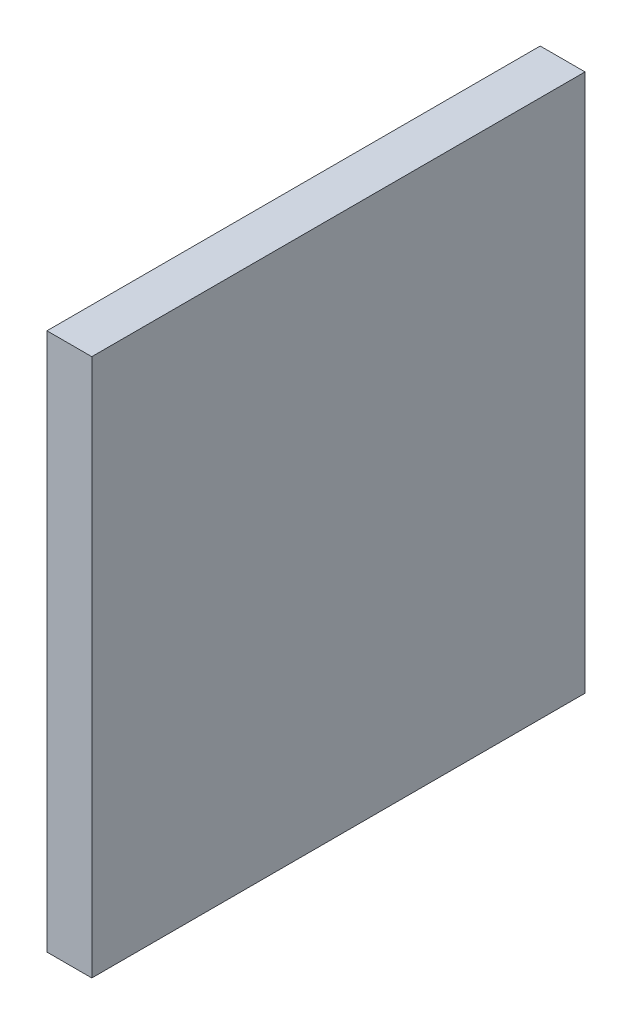
ISO-10303-21;
HEADER;
FILE_DESCRIPTION(('STEP AP214'),'2;1');
FILE_NAME('part.step','',(''),(''),'','','');
FILE_SCHEMA(('AUTOMOTIVE_DESIGN { 1 0 10303 214 1 1 1 1 }'));
ENDSEC;
DATA;
#1=APPLICATION_CONTEXT('core data for automotive mechanical design processes');
#2=APPLICATION_PROTOCOL_DEFINITION('international standard','automotive_design',2000,#1);
#3=PRODUCT_CONTEXT('',#1,'mechanical');
#4=PRODUCT('Part','Part','',(#3));
#5=PRODUCT_RELATED_PRODUCT_CATEGORY('part','',(#4));
#6=PRODUCT_DEFINITION_FORMATION('','',#4);
#7=PRODUCT_DEFINITION_CONTEXT('part definition',#1,'design');
#8=PRODUCT_DEFINITION('design','',#6,#7);
#9=PRODUCT_DEFINITION_SHAPE('','',#8);
#10=(LENGTH_UNIT() NAMED_UNIT(*) SI_UNIT(.MILLI.,.METRE.));
#11=(NAMED_UNIT(*) PLANE_ANGLE_UNIT() SI_UNIT($,.RADIAN.));
#12=(NAMED_UNIT(*) SI_UNIT($,.STERADIAN.) SOLID_ANGLE_UNIT());
#13=UNCERTAINTY_MEASURE_WITH_UNIT(LENGTH_MEASURE(1.E-05),#10,'distance_accuracy_value','');
#14=(GEOMETRIC_REPRESENTATION_CONTEXT(3) GLOBAL_UNCERTAINTY_ASSIGNED_CONTEXT((#13)) GLOBAL_UNIT_ASSIGNED_CONTEXT((#10,
#11,#12)) REPRESENTATION_CONTEXT('',''));
#15=CARTESIAN_POINT('',(0.,0.,0.));
#16=DIRECTION('',(0.,0.,1.));
#17=DIRECTION('',(1.,0.,0.));
#18=AXIS2_PLACEMENT_3D('',#15,#16,#17);
#19=CARTESIAN_POINT('',(28.99,3.37,5.7));
#20=DIRECTION('',(1.,0.,0.));
#21=DIRECTION('',(0.,0.,-1.));
#22=AXIS2_PLACEMENT_3D('',#19,#20,#21);
#23=PLANE('',#22);
#24=DIRECTION('',(0.,1.,0.));
#25=VECTOR('',#24,1.);
#26=CARTESIAN_POINT('',(28.99,5.17,7.35));
#27=LINE('',#26,#25);
#28=CARTESIAN_POINT('',(28.99,5.17,7.35));
#29=VERTEX_POINT('',#28);
#30=CARTESIAN_POINT('',(28.99,1.57,7.35));
#31=VERTEX_POINT('',#30);
#32=EDGE_CURVE('E79',#29,#31,#27,.F.);
#33=ORIENTED_EDGE('',*,*,#32,.F.);
#34=DIRECTION('',(0.,0.,1.));
#35=VECTOR('',#34,1.);
#36=CARTESIAN_POINT('',(28.99,5.17,4.05));
#37=LINE('',#36,#35);
#38=CARTESIAN_POINT('',(28.99,5.17,4.05));
#39=VERTEX_POINT('',#38);
#40=EDGE_CURVE('E55',#39,#29,#37,.T.);
#41=ORIENTED_EDGE('',*,*,#40,.F.);
#42=DIRECTION('',(0.,1.,0.));
#43=VECTOR('',#42,1.);
#44=CARTESIAN_POINT('',(28.99,1.57,4.05));
#45=LINE('',#44,#43);
#46=CARTESIAN_POINT('',(28.99,1.57,4.05));
#47=VERTEX_POINT('',#46);
#48=EDGE_CURVE('E57',#47,#39,#45,.T.);
#49=ORIENTED_EDGE('',*,*,#48,.F.);
#50=DIRECTION('',(0.,0.,-1.));
#51=VECTOR('',#50,1.);
#52=CARTESIAN_POINT('',(28.99,1.57,7.35));
#53=LINE('',#52,#51);
#54=EDGE_CURVE('E20',#31,#47,#53,.T.);
#55=ORIENTED_EDGE('',*,*,#54,.F.);
#56=EDGE_LOOP('',(#33,#41,#49,#55));
#57=FACE_BOUND('',#56,.T.);
#58=ADVANCED_FACE('F17',(#57),#23,.F.);
#59=CARTESIAN_POINT('',(28.99,1.57,7.35));
#60=DIRECTION('',(0.,-1.,0.));
#61=DIRECTION('',(0.,0.,-1.));
#62=AXIS2_PLACEMENT_3D('',#59,#60,#61);
#63=PLANE('',#62);
#64=DIRECTION('',(0.,0.,-1.));
#65=VECTOR('',#64,1.);
#66=CARTESIAN_POINT('',(29.29,1.57,5.7));
#67=LINE('',#66,#65);
#68=CARTESIAN_POINT('',(29.29,1.57,7.35));
#69=VERTEX_POINT('',#68);
#70=CARTESIAN_POINT('',(29.29,1.57,4.05));
#71=VERTEX_POINT('',#70);
#72=EDGE_CURVE('E83',#69,#71,#67,.T.);
#73=ORIENTED_EDGE('',*,*,#72,.F.);
#74=DIRECTION('',(1.,0.,0.));
#75=VECTOR('',#74,1.);
#76=CARTESIAN_POINT('',(28.99,1.57,7.35));
#77=LINE('',#76,#75);
#78=EDGE_CURVE('E68',#31,#69,#77,.T.);
#79=ORIENTED_EDGE('',*,*,#78,.F.);
#80=ORIENTED_EDGE('',*,*,#54,.T.);
#81=DIRECTION('',(-1.,0.,0.));
#82=VECTOR('',#81,1.);
#83=CARTESIAN_POINT('',(28.99,1.57,4.05));
#84=LINE('',#83,#82);
#85=EDGE_CURVE('E63',#71,#47,#84,.T.);
#86=ORIENTED_EDGE('',*,*,#85,.F.);
#87=EDGE_LOOP('',(#73,#79,#80,#86));
#88=FACE_BOUND('',#87,.T.);
#89=ADVANCED_FACE('F65',(#88),#63,.T.);
#90=CARTESIAN_POINT('',(28.99,1.57,4.05));
#91=DIRECTION('',(0.,0.,-1.));
#92=DIRECTION('',(-1.,0.,0.));
#93=AXIS2_PLACEMENT_3D('',#90,#91,#92);
#94=PLANE('',#93);
#95=DIRECTION('',(0.,1.,0.));
#96=VECTOR('',#95,1.);
#97=CARTESIAN_POINT('',(29.29,3.37,4.05));
#98=LINE('',#97,#96);
#99=CARTESIAN_POINT('',(29.29,5.17,4.05));
#100=VERTEX_POINT('',#99);
#101=EDGE_CURVE('E72',#71,#100,#98,.T.);
#102=ORIENTED_EDGE('',*,*,#101,.F.);
#103=ORIENTED_EDGE('',*,*,#85,.T.);
#104=ORIENTED_EDGE('',*,*,#48,.T.);
#105=DIRECTION('',(1.,0.,0.));
#106=VECTOR('',#105,1.);
#107=CARTESIAN_POINT('',(28.99,5.17,4.05));
#108=LINE('',#107,#106);
#109=EDGE_CURVE('E75',#100,#39,#108,.F.);
#110=ORIENTED_EDGE('',*,*,#109,.F.);
#111=EDGE_LOOP('',(#102,#103,#104,#110));
#112=FACE_BOUND('',#111,.T.);
#113=ADVANCED_FACE('F70',(#112),#94,.T.);
#114=CARTESIAN_POINT('',(28.99,5.17,4.05));
#115=DIRECTION('',(0.,1.,0.));
#116=DIRECTION('',(0.,0.,1.));
#117=AXIS2_PLACEMENT_3D('',#114,#115,#116);
#118=PLANE('',#117);
#119=DIRECTION('',(0.,0.,-1.));
#120=VECTOR('',#119,1.);
#121=CARTESIAN_POINT('',(29.29,5.17,5.7));
#122=LINE('',#121,#120);
#123=CARTESIAN_POINT('',(29.29,5.17,7.35));
#124=VERTEX_POINT('',#123);
#125=EDGE_CURVE('E26',#100,#124,#122,.F.);
#126=ORIENTED_EDGE('',*,*,#125,.F.);
#127=ORIENTED_EDGE('',*,*,#109,.T.);
#128=ORIENTED_EDGE('',*,*,#40,.T.);
#129=DIRECTION('',(1.,0.,0.));
#130=VECTOR('',#129,1.);
#131=CARTESIAN_POINT('',(28.99,5.17,7.35));
#132=LINE('',#131,#130);
#133=EDGE_CURVE('E35',#124,#29,#132,.F.);
#134=ORIENTED_EDGE('',*,*,#133,.F.);
#135=EDGE_LOOP('',(#126,#127,#128,#134));
#136=FACE_BOUND('',#135,.T.);
#137=ADVANCED_FACE('F89',(#136),#118,.T.);
#138=CARTESIAN_POINT('',(28.99,5.17,7.35));
#139=DIRECTION('',(0.,0.,1.));
#140=DIRECTION('',(1.,0.,0.));
#141=AXIS2_PLACEMENT_3D('',#138,#139,#140);
#142=PLANE('',#141);
#143=DIRECTION('',(0.,1.,0.));
#144=VECTOR('',#143,1.);
#145=CARTESIAN_POINT('',(29.29,3.37,7.35));
#146=LINE('',#145,#144);
#147=EDGE_CURVE('E11',#124,#69,#146,.F.);
#148=ORIENTED_EDGE('',*,*,#147,.F.);
#149=ORIENTED_EDGE('',*,*,#133,.T.);
#150=ORIENTED_EDGE('',*,*,#32,.T.);
#151=ORIENTED_EDGE('',*,*,#78,.T.);
#152=EDGE_LOOP('',(#148,#149,#150,#151));
#153=FACE_BOUND('',#152,.T.);
#154=ADVANCED_FACE('F91',(#153),#142,.T.);
#155=CARTESIAN_POINT('',(29.29,3.37,5.7));
#156=DIRECTION('',(1.,0.,0.));
#157=DIRECTION('',(0.,0.,-1.));
#158=AXIS2_PLACEMENT_3D('',#155,#156,#157);
#159=PLANE('',#158);
#160=ORIENTED_EDGE('',*,*,#125,.T.);
#161=ORIENTED_EDGE('',*,*,#147,.T.);
#162=ORIENTED_EDGE('',*,*,#72,.T.);
#163=ORIENTED_EDGE('',*,*,#101,.T.);
#164=EDGE_LOOP('',(#160,#161,#162,#163));
#165=FACE_BOUND('',#164,.T.);
#166=ADVANCED_FACE('F88',(#165),#159,.T.);
#167=CLOSED_SHELL('',(#58,#89,#113,#137,#154,#166));
#168=MANIFOLD_SOLID_BREP('B1',#167);
#169=ADVANCED_BREP_SHAPE_REPRESENTATION('',(#18,#168),#14);
#170=SHAPE_DEFINITION_REPRESENTATION(#9,#169);
ENDSEC;
END-ISO-10303-21;
